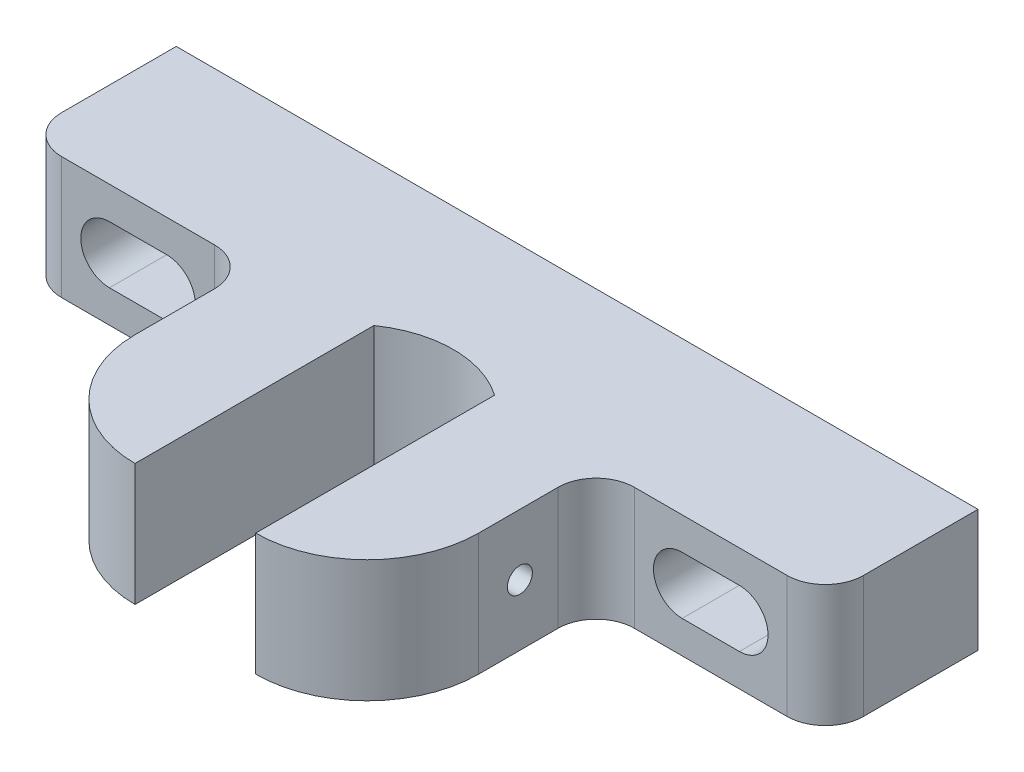
ISO-10303-21;
HEADER;
FILE_DESCRIPTION(('STEP AP214'),'2;1');
FILE_NAME('part.step','',(''),(''),'','','');
FILE_SCHEMA(('AUTOMOTIVE_DESIGN { 1 0 10303 214 1 1 1 1 }'));
ENDSEC;
DATA;
#1=APPLICATION_CONTEXT('core data for automotive mechanical design processes');
#2=APPLICATION_PROTOCOL_DEFINITION('international standard','automotive_design',2000,#1);
#3=PRODUCT_CONTEXT('',#1,'mechanical');
#4=PRODUCT('Part','Part','',(#3));
#5=PRODUCT_RELATED_PRODUCT_CATEGORY('part','',(#4));
#6=PRODUCT_DEFINITION_FORMATION('','',#4);
#7=PRODUCT_DEFINITION_CONTEXT('part definition',#1,'design');
#8=PRODUCT_DEFINITION('design','',#6,#7);
#9=PRODUCT_DEFINITION_SHAPE('','',#8);
#10=(LENGTH_UNIT() NAMED_UNIT(*) SI_UNIT(.MILLI.,.METRE.));
#11=(NAMED_UNIT(*) PLANE_ANGLE_UNIT() SI_UNIT($,.RADIAN.));
#12=(NAMED_UNIT(*) SI_UNIT($,.STERADIAN.) SOLID_ANGLE_UNIT());
#13=UNCERTAINTY_MEASURE_WITH_UNIT(LENGTH_MEASURE(1.E-05),#10,'distance_accuracy_value','');
#14=(GEOMETRIC_REPRESENTATION_CONTEXT(3) GLOBAL_UNCERTAINTY_ASSIGNED_CONTEXT((#13)) GLOBAL_UNIT_ASSIGNED_CONTEXT((#10,
#11,#12)) REPRESENTATION_CONTEXT('',''));
#15=CARTESIAN_POINT('',(0.,0.,0.));
#16=DIRECTION('',(0.,0.,1.));
#17=DIRECTION('',(1.,0.,0.));
#18=AXIS2_PLACEMENT_3D('',#15,#16,#17);
#19=CARTESIAN_POINT('',(28.5749999999999,24.2887500000001,44.9579999999981));
#20=DIRECTION('',(-1.,0.,0.));
#21=DIRECTION('',(0.,0.,1.));
#22=AXIS2_PLACEMENT_3D('',#19,#20,#21);
#23=PLANE('',#22);
#24=DIRECTION('',(0.,0.,-1.));
#25=VECTOR('',#24,1.);
#26=CARTESIAN_POINT('',(28.5749999999999,3.96875000000006,44.9579999999981));
#27=LINE('',#26,#25);
#28=CARTESIAN_POINT('',(28.5749999999999,3.96875000000006,44.9579999999981));
#29=VERTEX_POINT('',#28);
#30=CARTESIAN_POINT('',(28.5749999999999,3.96875000000006,31.75));
#31=VERTEX_POINT('',#30);
#32=EDGE_CURVE('E370',#29,#31,#27,.T.);
#33=ORIENTED_EDGE('',*,*,#32,.T.);
#34=DIRECTION('',(0.,-1.,0.));
#35=VECTOR('',#34,1.);
#36=CARTESIAN_POINT('',(28.5749999999999,24.2887500000001,31.75));
#37=LINE('',#36,#35);
#38=CARTESIAN_POINT('',(28.5749999999999,24.2887500000001,31.75));
#39=VERTEX_POINT('',#38);
#40=EDGE_CURVE('E420',#39,#31,#37,.T.);
#41=ORIENTED_EDGE('',*,*,#40,.F.);
#42=DIRECTION('',(0.,0.,-1.));
#43=VECTOR('',#42,1.);
#44=CARTESIAN_POINT('',(28.5749999999999,24.2887500000001,44.9579999999981));
#45=LINE('',#44,#43);
#46=CARTESIAN_POINT('',(28.5749999999999,24.2887500000001,44.9579999999981));
#47=VERTEX_POINT('',#46);
#48=EDGE_CURVE('E327',#47,#39,#45,.T.);
#49=ORIENTED_EDGE('',*,*,#48,.F.);
#50=DIRECTION('',(0.,-1.,0.));
#51=VECTOR('',#50,1.);
#52=CARTESIAN_POINT('',(28.5749999999999,24.2887500000001,44.9579999999981));
#53=LINE('',#52,#51);
#54=EDGE_CURVE('E423',#47,#29,#53,.T.);
#55=ORIENTED_EDGE('',*,*,#54,.T.);
#56=EDGE_LOOP('',(#33,#41,#49,#55));
#57=FACE_BOUND('',#56,.T.);
#58=CARTESIAN_POINT('',(28.5749999999999,14.1287500000001,38.1));
#59=DIRECTION('',(-1.,0.,0.));
#60=DIRECTION('',(0.,0.,1.));
#61=AXIS2_PLACEMENT_3D('',#58,#59,#60);
#62=CIRCLE('',#61,2.07645);
#63=CARTESIAN_POINT('',(28.5749999999999,14.1287500000001,40.17645));
#64=VERTEX_POINT('',#63);
#65=EDGE_CURVE('E731',#64,#64,#62,.F.);
#66=ORIENTED_EDGE('',*,*,#65,.F.);
#67=EDGE_LOOP('',(#66));
#68=FACE_BOUND('',#67,.T.);
#69=ADVANCED_FACE('F39',(#57,#68),#23,.F.);
#70=CARTESIAN_POINT('',(10.032999999998,24.2887500000001,23.7616280212914));
#71=DIRECTION('',(1.,0.,0.));
#72=DIRECTION('',(0.,0.,-1.));
#73=AXIS2_PLACEMENT_3D('',#70,#71,#72);
#74=PLANE('',#73);
#75=DIRECTION('',(0.,0.,1.));
#76=VECTOR('',#75,1.);
#77=CARTESIAN_POINT('',(10.032999999998,3.96875000000006,23.7616280212914));
#78=LINE('',#77,#76);
#79=CARTESIAN_POINT('',(10.032999999998,3.96875000000006,23.7616280212914));
#80=VERTEX_POINT('',#79);
#81=CARTESIAN_POINT('',(10.032999999998,3.96875000000006,63.5));
#82=VERTEX_POINT('',#81);
#83=EDGE_CURVE('E362',#80,#82,#78,.T.);
#84=ORIENTED_EDGE('',*,*,#83,.T.);
#85=DIRECTION('',(0.,-1.,0.));
#86=VECTOR('',#85,1.);
#87=CARTESIAN_POINT('',(10.032999999998,24.2887500000001,63.5));
#88=LINE('',#87,#86);
#89=CARTESIAN_POINT('',(10.032999999998,24.2887500000001,63.5));
#90=VERTEX_POINT('',#89);
#91=EDGE_CURVE('E426',#90,#82,#88,.T.);
#92=ORIENTED_EDGE('',*,*,#91,.F.);
#93=DIRECTION('',(0.,0.,1.));
#94=VECTOR('',#93,1.);
#95=CARTESIAN_POINT('',(10.032999999998,24.2887500000001,23.7616280212914));
#96=LINE('',#95,#94);
#97=CARTESIAN_POINT('',(10.032999999998,24.2887500000001,23.7616280212914));
#98=VERTEX_POINT('',#97);
#99=EDGE_CURVE('E318',#98,#90,#96,.T.);
#100=ORIENTED_EDGE('',*,*,#99,.F.);
#101=DIRECTION('',(0.,-1.,0.));
#102=VECTOR('',#101,1.);
#103=CARTESIAN_POINT('',(10.032999999998,24.2887500000001,23.7616280212914));
#104=LINE('',#103,#102);
#105=EDGE_CURVE('E358',#98,#80,#104,.T.);
#106=ORIENTED_EDGE('',*,*,#105,.T.);
#107=EDGE_LOOP('',(#84,#92,#100,#106));
#108=FACE_BOUND('',#107,.T.);
#109=CARTESIAN_POINT('',(10.032999999998,14.1287500000001,38.1));
#110=DIRECTION('',(1.,0.,0.));
#111=DIRECTION('',(0.,0.,-1.));
#112=AXIS2_PLACEMENT_3D('',#109,#110,#111);
#113=CIRCLE('',#112,2.07645);
#114=CARTESIAN_POINT('',(10.032999999998,14.1287500000001,36.02355));
#115=VERTEX_POINT('',#114);
#116=EDGE_CURVE('E43',#115,#115,#113,.F.);
#117=ORIENTED_EDGE('',*,*,#116,.F.);
#118=EDGE_LOOP('',(#117));
#119=FACE_BOUND('',#118,.T.);
#120=ADVANCED_FACE('F528',(#108,#119),#74,.F.);
#121=CARTESIAN_POINT('',(-66.6749999999999,24.2887500000001,63.5));
#122=DIRECTION('',(1.,0.,0.));
#123=DIRECTION('',(0.,0.,-1.));
#124=AXIS2_PLACEMENT_3D('',#121,#122,#123);
#125=PLANE('',#124);
#126=DIRECTION('',(0.,0.,-1.));
#127=VECTOR('',#126,1.);
#128=CARTESIAN_POINT('',(-66.6749999999999,3.96875000000006,63.5));
#129=LINE('',#128,#127);
#130=CARTESIAN_POINT('',(-66.6749999999999,3.96875000000006,19.05));
#131=VERTEX_POINT('',#130);
#132=CARTESIAN_POINT('',(-66.6749999999999,3.96875000000006,0.));
#133=VERTEX_POINT('',#132);
#134=EDGE_CURVE('E455',#131,#133,#129,.T.);
#135=ORIENTED_EDGE('',*,*,#134,.F.);
#136=DIRECTION('',(0.,-1.,0.));
#137=VECTOR('',#136,1.);
#138=CARTESIAN_POINT('',(-66.6749999999999,24.2887500000001,19.05));
#139=LINE('',#138,#137);
#140=CARTESIAN_POINT('',(-66.6749999999999,24.2887500000001,19.05));
#141=VERTEX_POINT('',#140);
#142=EDGE_CURVE('E481',#131,#141,#139,.F.);
#143=ORIENTED_EDGE('',*,*,#142,.T.);
#144=DIRECTION('',(0.,0.,-1.));
#145=VECTOR('',#144,1.);
#146=CARTESIAN_POINT('',(-66.6749999999999,24.2887500000001,63.5));
#147=LINE('',#146,#145);
#148=CARTESIAN_POINT('',(-66.6749999999999,24.2887500000001,0.));
#149=VERTEX_POINT('',#148);
#150=EDGE_CURVE('E446',#141,#149,#147,.T.);
#151=ORIENTED_EDGE('',*,*,#150,.T.);
#152=DIRECTION('',(0.,-1.,0.));
#153=VECTOR('',#152,1.);
#154=CARTESIAN_POINT('',(-66.6749999999999,24.2887500000001,0.));
#155=LINE('',#154,#153);
#156=EDGE_CURVE('E403',#149,#133,#155,.T.);
#157=ORIENTED_EDGE('',*,*,#156,.T.);
#158=EDGE_LOOP('',(#135,#143,#151,#157));
#159=FACE_BOUND('',#158,.T.);
#160=ADVANCED_FACE('F534',(#159),#125,.F.);
#161=CARTESIAN_POINT('',(-66.6749999999999,3.96875000000006,63.5));
#162=DIRECTION('',(0.,1.,0.));
#163=DIRECTION('',(0.,0.,1.));
#164=AXIS2_PLACEMENT_3D('',#161,#162,#163);
#165=PLANE('',#164);
#166=DIRECTION('',(0.,0.,-1.));
#167=VECTOR('',#166,1.);
#168=CARTESIAN_POINT('',(66.6750000000001,3.96875000000006,63.5));
#169=LINE('',#168,#167);
#170=CARTESIAN_POINT('',(66.6750000000001,3.96875000000006,19.05));
#171=VERTEX_POINT('',#170);
#172=CARTESIAN_POINT('',(66.6750000000001,3.96875000000006,0.));
#173=VERTEX_POINT('',#172);
#174=EDGE_CURVE('E452',#171,#173,#169,.T.);
#175=ORIENTED_EDGE('',*,*,#174,.F.);
#176=CARTESIAN_POINT('',(60.3250000000001,3.96875000000006,19.05));
#177=DIRECTION('',(0.,1.,0.));
#178=DIRECTION('',(0.,0.,1.));
#179=AXIS2_PLACEMENT_3D('',#176,#177,#178);
#180=CIRCLE('',#179,6.35);
#181=CARTESIAN_POINT('',(60.3250000000001,3.96875000000006,25.4));
#182=VERTEX_POINT('',#181);
#183=EDGE_CURVE('E465',#171,#182,#180,.F.);
#184=ORIENTED_EDGE('',*,*,#183,.T.);
#185=DIRECTION('',(1.,0.,0.));
#186=VECTOR('',#185,1.);
#187=CARTESIAN_POINT('',(66.6749999999999,3.96875000000006,25.4));
#188=LINE('',#187,#186);
#189=CARTESIAN_POINT('',(34.9249999999999,3.96875000000006,25.4));
#190=VERTEX_POINT('',#189);
#191=EDGE_CURVE('E378',#190,#182,#188,.T.);
#192=ORIENTED_EDGE('',*,*,#191,.F.);
#193=CARTESIAN_POINT('',(34.9249999999999,3.96875000000006,31.75));
#194=DIRECTION('',(0.,-1.,0.));
#195=DIRECTION('',(0.,0.,1.));
#196=AXIS2_PLACEMENT_3D('',#193,#194,#195);
#197=CIRCLE('',#196,6.35);
#198=EDGE_CURVE('E374',#31,#190,#197,.T.);
#199=ORIENTED_EDGE('',*,*,#198,.F.);
#200=ORIENTED_EDGE('',*,*,#32,.F.);
#201=CARTESIAN_POINT('',(10.032999999998,3.96875000000006,44.9579999999981));
#202=DIRECTION('',(0.,1.,0.));
#203=DIRECTION('',(0.,0.,1.));
#204=AXIS2_PLACEMENT_3D('',#201,#202,#203);
#205=CIRCLE('',#204,18.5420000000019);
#206=EDGE_CURVE('E366',#82,#29,#205,.T.);
#207=ORIENTED_EDGE('',*,*,#206,.F.);
#208=ORIENTED_EDGE('',*,*,#83,.F.);
#209=CARTESIAN_POINT('',(0.,3.96875000000006,38.1000000000061));
#210=DIRECTION('',(0.,-1.,0.));
#211=DIRECTION('',(0.,0.,1.));
#212=AXIS2_PLACEMENT_3D('',#209,#210,#211);
#213=CIRCLE('',#212,17.4999999999986);
#214=CARTESIAN_POINT('',(-10.032999999998,3.96875000000006,23.7616280212914));
#215=VERTEX_POINT('',#214);
#216=EDGE_CURVE('E304',#215,#80,#213,.T.);
#217=ORIENTED_EDGE('',*,*,#216,.F.);
#218=DIRECTION('',(0.,0.,-1.));
#219=VECTOR('',#218,1.);
#220=CARTESIAN_POINT('',(-10.032999999998,3.96875000000006,23.7616280212914));
#221=LINE('',#220,#219);
#222=CARTESIAN_POINT('',(-10.032999999998,3.96875000000006,63.5));
#223=VERTEX_POINT('',#222);
#224=EDGE_CURVE('E319',#223,#215,#221,.T.);
#225=ORIENTED_EDGE('',*,*,#224,.F.);
#226=CARTESIAN_POINT('',(-10.032999999998,3.96875000000006,44.9579999999981));
#227=DIRECTION('',(0.,1.,0.));
#228=DIRECTION('',(0.,0.,-1.));
#229=AXIS2_PLACEMENT_3D('',#226,#227,#228);
#230=CIRCLE('',#229,18.5420000000019);
#231=CARTESIAN_POINT('',(-28.5749999999999,3.96875000000006,44.9579999999981));
#232=VERTEX_POINT('',#231);
#233=EDGE_CURVE('E393',#232,#223,#230,.T.);
#234=ORIENTED_EDGE('',*,*,#233,.F.);
#235=DIRECTION('',(0.,0.,1.));
#236=VECTOR('',#235,1.);
#237=CARTESIAN_POINT('',(-28.5749999999999,3.96875000000006,44.9579999999981));
#238=LINE('',#237,#236);
#239=CARTESIAN_POINT('',(-28.5749999999999,3.96875000000006,31.75));
#240=VERTEX_POINT('',#239);
#241=EDGE_CURVE('E389',#240,#232,#238,.T.);
#242=ORIENTED_EDGE('',*,*,#241,.F.);
#243=CARTESIAN_POINT('',(-34.9249999999999,3.96875000000006,31.75));
#244=DIRECTION('',(0.,-1.,0.));
#245=DIRECTION('',(0.,0.,-1.));
#246=AXIS2_PLACEMENT_3D('',#243,#244,#245);
#247=CIRCLE('',#246,6.35);
#248=CARTESIAN_POINT('',(-34.9249999999999,3.96875000000006,25.4));
#249=VERTEX_POINT('',#248);
#250=EDGE_CURVE('E385',#249,#240,#247,.T.);
#251=ORIENTED_EDGE('',*,*,#250,.F.);
#252=DIRECTION('',(1.,0.,0.));
#253=VECTOR('',#252,1.);
#254=CARTESIAN_POINT('',(-66.6749999999999,3.96875000000006,25.4));
#255=LINE('',#254,#253);
#256=CARTESIAN_POINT('',(-60.3249999999999,3.96875000000006,25.4));
#257=VERTEX_POINT('',#256);
#258=EDGE_CURVE('E382',#257,#249,#255,.T.);
#259=ORIENTED_EDGE('',*,*,#258,.F.);
#260=CARTESIAN_POINT('',(-60.3249999999999,3.96875000000006,19.05));
#261=DIRECTION('',(0.,1.,0.));
#262=DIRECTION('',(0.,0.,1.));
#263=AXIS2_PLACEMENT_3D('',#260,#261,#262);
#264=CIRCLE('',#263,6.35);
#265=EDGE_CURVE('E462',#257,#131,#264,.F.);
#266=ORIENTED_EDGE('',*,*,#265,.T.);
#267=ORIENTED_EDGE('',*,*,#134,.T.);
#268=DIRECTION('',(1.,0.,0.));
#269=VECTOR('',#268,1.);
#270=CARTESIAN_POINT('',(-66.6749999999999,3.96875000000006,0.));
#271=LINE('',#270,#269);
#272=EDGE_CURVE('E434',#133,#173,#271,.T.);
#273=ORIENTED_EDGE('',*,*,#272,.T.);
#274=EDGE_LOOP('',(#175,#184,#192,#199,#200,#207,#208,#217,#225,#234,#242,#251,#259,#266,#267,#273));
#275=FACE_BOUND('',#274,.T.);
#276=ADVANCED_FACE('F561',(#275),#165,.F.);
#277=CARTESIAN_POINT('',(66.6750000000001,24.2887500000001,63.5));
#278=DIRECTION('',(-1.,0.,0.));
#279=DIRECTION('',(0.,0.,1.));
#280=AXIS2_PLACEMENT_3D('',#277,#278,#279);
#281=PLANE('',#280);
#282=DIRECTION('',(0.,0.,-1.));
#283=VECTOR('',#282,1.);
#284=CARTESIAN_POINT('',(66.6750000000001,24.2887500000001,63.5));
#285=LINE('',#284,#283);
#286=CARTESIAN_POINT('',(66.6750000000001,24.2887500000001,19.05));
#287=VERTEX_POINT('',#286);
#288=CARTESIAN_POINT('',(66.6750000000001,24.2887500000001,0.));
#289=VERTEX_POINT('',#288);
#290=EDGE_CURVE('E449',#287,#289,#285,.T.);
#291=ORIENTED_EDGE('',*,*,#290,.F.);
#292=DIRECTION('',(0.,-1.,0.));
#293=VECTOR('',#292,1.);
#294=CARTESIAN_POINT('',(66.6750000000001,24.2887500000001,19.05));
#295=LINE('',#294,#293);
#296=EDGE_CURVE('E458',#287,#171,#295,.T.);
#297=ORIENTED_EDGE('',*,*,#296,.T.);
#298=ORIENTED_EDGE('',*,*,#174,.T.);
#299=DIRECTION('',(0.,1.,0.));
#300=VECTOR('',#299,1.);
#301=CARTESIAN_POINT('',(66.6750000000001,24.2887500000001,0.));
#302=LINE('',#301,#300);
#303=EDGE_CURVE('E438',#173,#289,#302,.T.);
#304=ORIENTED_EDGE('',*,*,#303,.T.);
#305=EDGE_LOOP('',(#291,#297,#298,#304));
#306=FACE_BOUND('',#305,.T.);
#307=ADVANCED_FACE('F557',(#306),#281,.F.);
#308=CARTESIAN_POINT('',(-66.6749999999999,24.2887500000001,63.5));
#309=DIRECTION('',(0.,-1.,0.));
#310=DIRECTION('',(0.,0.,-1.));
#311=AXIS2_PLACEMENT_3D('',#308,#309,#310);
#312=PLANE('',#311);
#313=DIRECTION('',(1.,0.,0.));
#314=VECTOR('',#313,1.);
#315=CARTESIAN_POINT('',(66.6749999999999,24.2887500000001,25.4));
#316=LINE('',#315,#314);
#317=CARTESIAN_POINT('',(34.9249999999999,24.2887500000001,25.4));
#318=VERTEX_POINT('',#317);
#319=CARTESIAN_POINT('',(60.3250000000001,24.2887500000001,25.4));
#320=VERTEX_POINT('',#319);
#321=EDGE_CURVE('E335',#318,#320,#316,.T.);
#322=ORIENTED_EDGE('',*,*,#321,.T.);
#323=CARTESIAN_POINT('',(60.3250000000001,24.2887500000001,19.05));
#324=DIRECTION('',(0.,-1.,0.));
#325=DIRECTION('',(0.,0.,-1.));
#326=AXIS2_PLACEMENT_3D('',#323,#324,#325);
#327=CIRCLE('',#326,6.35);
#328=EDGE_CURVE('E474',#320,#287,#327,.F.);
#329=ORIENTED_EDGE('',*,*,#328,.T.);
#330=ORIENTED_EDGE('',*,*,#290,.T.);
#331=DIRECTION('',(-1.,0.,0.));
#332=VECTOR('',#331,1.);
#333=CARTESIAN_POINT('',(-66.6749999999999,24.2887500000001,0.));
#334=LINE('',#333,#332);
#335=EDGE_CURVE('E442',#289,#149,#334,.T.);
#336=ORIENTED_EDGE('',*,*,#335,.T.);
#337=ORIENTED_EDGE('',*,*,#150,.F.);
#338=CARTESIAN_POINT('',(-60.3249999999999,24.2887500000001,19.05));
#339=DIRECTION('',(0.,-1.,0.));
#340=DIRECTION('',(0.,0.,-1.));
#341=AXIS2_PLACEMENT_3D('',#338,#339,#340);
#342=CIRCLE('',#341,6.35);
#343=CARTESIAN_POINT('',(-60.3249999999999,24.2887500000001,25.4));
#344=VERTEX_POINT('',#343);
#345=EDGE_CURVE('E471',#141,#344,#342,.F.);
#346=ORIENTED_EDGE('',*,*,#345,.T.);
#347=DIRECTION('',(1.,0.,0.));
#348=VECTOR('',#347,1.);
#349=CARTESIAN_POINT('',(-66.6749999999999,24.2887500000001,25.4));
#350=LINE('',#349,#348);
#351=CARTESIAN_POINT('',(-34.9249999999999,24.2887500000001,25.4));
#352=VERTEX_POINT('',#351);
#353=EDGE_CURVE('E339',#344,#352,#350,.T.);
#354=ORIENTED_EDGE('',*,*,#353,.T.);
#355=CARTESIAN_POINT('',(-34.9249999999999,24.2887500000001,31.75));
#356=DIRECTION('',(0.,-1.,0.));
#357=DIRECTION('',(0.,0.,-1.));
#358=AXIS2_PLACEMENT_3D('',#355,#356,#357);
#359=CIRCLE('',#358,6.35);
#360=CARTESIAN_POINT('',(-28.5749999999999,24.2887500000001,31.75));
#361=VERTEX_POINT('',#360);
#362=EDGE_CURVE('E342',#352,#361,#359,.T.);
#363=ORIENTED_EDGE('',*,*,#362,.T.);
#364=DIRECTION('',(0.,0.,1.));
#365=VECTOR('',#364,1.);
#366=CARTESIAN_POINT('',(-28.5749999999999,24.2887500000001,44.9579999999981));
#367=LINE('',#366,#365);
#368=CARTESIAN_POINT('',(-28.5749999999999,24.2887500000001,44.9579999999981));
#369=VERTEX_POINT('',#368);
#370=EDGE_CURVE('E346',#361,#369,#367,.T.);
#371=ORIENTED_EDGE('',*,*,#370,.T.);
#372=CARTESIAN_POINT('',(-10.032999999998,24.2887500000001,44.9579999999981));
#373=DIRECTION('',(0.,1.,0.));
#374=DIRECTION('',(0.,0.,-1.));
#375=AXIS2_PLACEMENT_3D('',#372,#373,#374);
#376=CIRCLE('',#375,18.5420000000019);
#377=CARTESIAN_POINT('',(-10.032999999998,24.2887500000001,63.5));
#378=VERTEX_POINT('',#377);
#379=EDGE_CURVE('E350',#369,#378,#376,.T.);
#380=ORIENTED_EDGE('',*,*,#379,.T.);
#381=DIRECTION('',(0.,0.,-1.));
#382=VECTOR('',#381,1.);
#383=CARTESIAN_POINT('',(-10.032999999998,24.2887500000001,23.7616280212914));
#384=LINE('',#383,#382);
#385=CARTESIAN_POINT('',(-10.032999999998,24.2887500000001,23.7616280212914));
#386=VERTEX_POINT('',#385);
#387=EDGE_CURVE('E354',#378,#386,#384,.T.);
#388=ORIENTED_EDGE('',*,*,#387,.T.);
#389=CARTESIAN_POINT('',(0.,24.2887500000001,38.1000000000061));
#390=DIRECTION('',(0.,-1.,0.));
#391=DIRECTION('',(0.,0.,1.));
#392=AXIS2_PLACEMENT_3D('',#389,#390,#391);
#393=CIRCLE('',#392,17.4999999999986);
#394=EDGE_CURVE('E314',#386,#98,#393,.T.);
#395=ORIENTED_EDGE('',*,*,#394,.T.);
#396=ORIENTED_EDGE('',*,*,#99,.T.);
#397=CARTESIAN_POINT('',(10.032999999998,24.2887500000001,44.9579999999981));
#398=DIRECTION('',(0.,1.,0.));
#399=DIRECTION('',(0.,0.,1.));
#400=AXIS2_PLACEMENT_3D('',#397,#398,#399);
#401=CIRCLE('',#400,18.5420000000019);
#402=EDGE_CURVE('E323',#90,#47,#401,.T.);
#403=ORIENTED_EDGE('',*,*,#402,.T.);
#404=ORIENTED_EDGE('',*,*,#48,.T.);
#405=CARTESIAN_POINT('',(34.9249999999999,24.2887500000001,31.75));
#406=DIRECTION('',(0.,-1.,0.));
#407=DIRECTION('',(0.,0.,1.));
#408=AXIS2_PLACEMENT_3D('',#405,#406,#407);
#409=CIRCLE('',#408,6.35);
#410=EDGE_CURVE('E331',#39,#318,#409,.T.);
#411=ORIENTED_EDGE('',*,*,#410,.T.);
#412=EDGE_LOOP('',(#322,#329,#330,#336,#337,#346,#354,#363,#371,#380,#388,#395,#396,#403,#404,#411));
#413=FACE_BOUND('',#412,.T.);
#414=ADVANCED_FACE('F554',(#413),#312,.F.);
#415=CARTESIAN_POINT('',(-66.6749999999999,3.96875000000006,0.));
#416=DIRECTION('',(0.,0.,1.));
#417=DIRECTION('',(1.,0.,0.));
#418=AXIS2_PLACEMENT_3D('',#415,#416,#417);
#419=PLANE('',#418);
#420=DIRECTION('',(1.,0.,0.));
#421=VECTOR('',#420,1.);
#422=CARTESIAN_POINT('',(-52.3875,18.8912500000001,0.));
#423=LINE('',#422,#421);
#424=CARTESIAN_POINT('',(-52.3875,18.8912500000001,0.));
#425=VERTEX_POINT('',#424);
#426=CARTESIAN_POINT('',(-42.8625,18.8912500000001,0.));
#427=VERTEX_POINT('',#426);
#428=EDGE_CURVE('E263',#425,#427,#423,.T.);
#429=ORIENTED_EDGE('',*,*,#428,.F.);
#430=CARTESIAN_POINT('',(-52.3875,14.1287500000001,0.));
#431=DIRECTION('',(0.,0.,-1.));
#432=DIRECTION('',(-1.,0.,0.));
#433=AXIS2_PLACEMENT_3D('',#430,#431,#432);
#434=CIRCLE('',#433,4.7625);
#435=CARTESIAN_POINT('',(-52.3875,9.36625000000008,0.));
#436=VERTEX_POINT('',#435);
#437=EDGE_CURVE('E59',#436,#425,#434,.T.);
#438=ORIENTED_EDGE('',*,*,#437,.F.);
#439=DIRECTION('',(-1.,0.,0.));
#440=VECTOR('',#439,1.);
#441=CARTESIAN_POINT('',(-52.3875,9.36625000000008,0.));
#442=LINE('',#441,#440);
#443=CARTESIAN_POINT('',(-42.8625,9.36625000000008,0.));
#444=VERTEX_POINT('',#443);
#445=EDGE_CURVE('E271',#444,#436,#442,.T.);
#446=ORIENTED_EDGE('',*,*,#445,.F.);
#447=CARTESIAN_POINT('',(-42.8625,14.1287500000001,0.));
#448=DIRECTION('',(0.,0.,-1.));
#449=DIRECTION('',(-1.,0.,0.));
#450=AXIS2_PLACEMENT_3D('',#447,#448,#449);
#451=CIRCLE('',#450,4.7625);
#452=EDGE_CURVE('E253',#427,#444,#451,.T.);
#453=ORIENTED_EDGE('',*,*,#452,.F.);
#454=EDGE_LOOP('',(#429,#438,#446,#453));
#455=FACE_BOUND('',#454,.T.);
#456=DIRECTION('',(-1.,0.,0.));
#457=VECTOR('',#456,1.);
#458=CARTESIAN_POINT('',(52.3875,9.36625000000008,0.));
#459=LINE('',#458,#457);
#460=CARTESIAN_POINT('',(52.3875,9.36625000000008,0.));
#461=VERTEX_POINT('',#460);
#462=CARTESIAN_POINT('',(42.8625,9.36625000000007,0.));
#463=VERTEX_POINT('',#462);
#464=EDGE_CURVE('E288',#461,#463,#459,.T.);
#465=ORIENTED_EDGE('',*,*,#464,.F.);
#466=CARTESIAN_POINT('',(52.3875,14.1287500000001,0.));
#467=DIRECTION('',(0.,0.,-1.));
#468=DIRECTION('',(1.,0.,0.));
#469=AXIS2_PLACEMENT_3D('',#466,#467,#468);
#470=CIRCLE('',#469,4.7625);
#471=CARTESIAN_POINT('',(52.3875,18.8912500000001,0.));
#472=VERTEX_POINT('',#471);
#473=EDGE_CURVE('E281',#472,#461,#470,.T.);
#474=ORIENTED_EDGE('',*,*,#473,.F.);
#475=DIRECTION('',(1.,0.,0.));
#476=VECTOR('',#475,1.);
#477=CARTESIAN_POINT('',(52.3875,18.8912500000001,0.));
#478=LINE('',#477,#476);
#479=CARTESIAN_POINT('',(42.8625,18.8912500000001,0.));
#480=VERTEX_POINT('',#479);
#481=EDGE_CURVE('E296',#480,#472,#478,.T.);
#482=ORIENTED_EDGE('',*,*,#481,.F.);
#483=CARTESIAN_POINT('',(42.8625,14.1287500000001,0.));
#484=DIRECTION('',(0.,0.,-1.));
#485=DIRECTION('',(1.,0.,0.));
#486=AXIS2_PLACEMENT_3D('',#483,#484,#485);
#487=CIRCLE('',#486,4.7625);
#488=EDGE_CURVE('E292',#463,#480,#487,.T.);
#489=ORIENTED_EDGE('',*,*,#488,.F.);
#490=EDGE_LOOP('',(#465,#474,#482,#489));
#491=FACE_BOUND('',#490,.T.);
#492=ORIENTED_EDGE('',*,*,#156,.F.);
#493=ORIENTED_EDGE('',*,*,#335,.F.);
#494=ORIENTED_EDGE('',*,*,#303,.F.);
#495=ORIENTED_EDGE('',*,*,#272,.F.);
#496=EDGE_LOOP('',(#492,#493,#494,#495));
#497=FACE_BOUND('',#496,.T.);
#498=ADVANCED_FACE('F268',(#455,#491,#497),#419,.F.);
#499=CARTESIAN_POINT('',(0.,24.2887500000001,38.1000000000061));
#500=DIRECTION('',(0.,-1.,0.));
#501=DIRECTION('',(0.,0.,-1.));
#502=AXIS2_PLACEMENT_3D('',#499,#500,#501);
#503=CYLINDRICAL_SURFACE('',#502,17.4999999999986);
#504=ORIENTED_EDGE('',*,*,#216,.T.);
#505=ORIENTED_EDGE('',*,*,#105,.F.);
#506=ORIENTED_EDGE('',*,*,#394,.F.);
#507=DIRECTION('',(0.,-1.,0.));
#508=VECTOR('',#507,1.);
#509=CARTESIAN_POINT('',(-10.032999999998,24.2887500000001,23.7616280212914));
#510=LINE('',#509,#508);
#511=EDGE_CURVE('E400',#386,#215,#510,.T.);
#512=ORIENTED_EDGE('',*,*,#511,.T.);
#513=EDGE_LOOP('',(#504,#505,#506,#512));
#514=FACE_BOUND('',#513,.T.);
#515=ADVANCED_FACE('F547',(#514),#503,.F.);
#516=CARTESIAN_POINT('',(-10.032999999998,24.2887500000001,23.7616280212914));
#517=DIRECTION('',(-1.,0.,0.));
#518=DIRECTION('',(0.,0.,1.));
#519=AXIS2_PLACEMENT_3D('',#516,#517,#518);
#520=PLANE('',#519);
#521=ORIENTED_EDGE('',*,*,#224,.T.);
#522=ORIENTED_EDGE('',*,*,#511,.F.);
#523=ORIENTED_EDGE('',*,*,#387,.F.);
#524=DIRECTION('',(0.,-1.,0.));
#525=VECTOR('',#524,1.);
#526=CARTESIAN_POINT('',(-10.032999999998,24.2887500000001,63.5));
#527=LINE('',#526,#525);
#528=EDGE_CURVE('E404',#378,#223,#527,.T.);
#529=ORIENTED_EDGE('',*,*,#528,.T.);
#530=EDGE_LOOP('',(#521,#522,#523,#529));
#531=FACE_BOUND('',#530,.T.);
#532=ADVANCED_FACE('F550',(#531),#520,.F.);
#533=CARTESIAN_POINT('',(-10.032999999998,24.2887500000001,44.9579999999981));
#534=DIRECTION('',(0.,-1.,0.));
#535=DIRECTION('',(0.,0.,-1.));
#536=AXIS2_PLACEMENT_3D('',#533,#534,#535);
#537=CYLINDRICAL_SURFACE('',#536,18.5420000000019);
#538=ORIENTED_EDGE('',*,*,#233,.T.);
#539=ORIENTED_EDGE('',*,*,#528,.F.);
#540=ORIENTED_EDGE('',*,*,#379,.F.);
#541=DIRECTION('',(0.,-1.,0.));
#542=VECTOR('',#541,1.);
#543=CARTESIAN_POINT('',(-28.5749999999999,24.2887500000001,44.9579999999981));
#544=LINE('',#543,#542);
#545=EDGE_CURVE('E407',#369,#232,#544,.T.);
#546=ORIENTED_EDGE('',*,*,#545,.T.);
#547=EDGE_LOOP('',(#538,#539,#540,#546));
#548=FACE_BOUND('',#547,.T.);
#549=ADVANCED_FACE('F605',(#548),#537,.T.);
#550=CARTESIAN_POINT('',(-28.5749999999999,24.2887500000001,44.9579999999981));
#551=DIRECTION('',(1.,0.,0.));
#552=DIRECTION('',(0.,0.,-1.));
#553=AXIS2_PLACEMENT_3D('',#550,#551,#552);
#554=PLANE('',#553);
#555=ORIENTED_EDGE('',*,*,#241,.T.);
#556=ORIENTED_EDGE('',*,*,#545,.F.);
#557=ORIENTED_EDGE('',*,*,#370,.F.);
#558=DIRECTION('',(0.,-1.,0.));
#559=VECTOR('',#558,1.);
#560=CARTESIAN_POINT('',(-28.5749999999999,24.2887500000001,31.75));
#561=LINE('',#560,#559);
#562=EDGE_CURVE('E410',#361,#240,#561,.T.);
#563=ORIENTED_EDGE('',*,*,#562,.T.);
#564=EDGE_LOOP('',(#555,#556,#557,#563));
#565=FACE_BOUND('',#564,.T.);
#566=ADVANCED_FACE('F603',(#565),#554,.F.);
#567=CARTESIAN_POINT('',(-34.9249999999999,24.2887500000001,31.75));
#568=DIRECTION('',(0.,-1.,0.));
#569=DIRECTION('',(0.,0.,-1.));
#570=AXIS2_PLACEMENT_3D('',#567,#568,#569);
#571=CYLINDRICAL_SURFACE('',#570,6.35);
#572=ORIENTED_EDGE('',*,*,#250,.T.);
#573=ORIENTED_EDGE('',*,*,#562,.F.);
#574=ORIENTED_EDGE('',*,*,#362,.F.);
#575=DIRECTION('',(0.,-1.,0.));
#576=VECTOR('',#575,1.);
#577=CARTESIAN_POINT('',(-34.9249999999999,24.2887500000001,25.4));
#578=LINE('',#577,#576);
#579=EDGE_CURVE('E413',#352,#249,#578,.T.);
#580=ORIENTED_EDGE('',*,*,#579,.T.);
#581=EDGE_LOOP('',(#572,#573,#574,#580));
#582=FACE_BOUND('',#581,.T.);
#583=ADVANCED_FACE('F598',(#582),#571,.F.);
#584=CARTESIAN_POINT('',(-66.6749999999999,24.2887500000001,25.4));
#585=DIRECTION('',(0.,0.,-1.));
#586=DIRECTION('',(-1.,0.,0.));
#587=AXIS2_PLACEMENT_3D('',#584,#585,#586);
#588=PLANE('',#587);
#589=DIRECTION('',(-1.,0.,0.));
#590=VECTOR('',#589,1.);
#591=CARTESIAN_POINT('',(-66.6749999999999,9.36625000000008,25.4));
#592=LINE('',#591,#590);
#593=CARTESIAN_POINT('',(-42.8625,9.36625000000008,25.4));
#594=VERTEX_POINT('',#593);
#595=CARTESIAN_POINT('',(-52.3875,9.36625000000008,25.4));
#596=VERTEX_POINT('',#595);
#597=EDGE_CURVE('E49',#594,#596,#592,.T.);
#598=ORIENTED_EDGE('',*,*,#597,.T.);
#599=CARTESIAN_POINT('',(-52.3875,14.1287500000001,25.4));
#600=DIRECTION('',(0.,0.,-1.));
#601=DIRECTION('',(-1.,0.,0.));
#602=AXIS2_PLACEMENT_3D('',#599,#600,#601);
#603=CIRCLE('',#602,4.7625);
#604=CARTESIAN_POINT('',(-52.3875,18.8912500000001,25.4));
#605=VERTEX_POINT('',#604);
#606=EDGE_CURVE('E11',#596,#605,#603,.T.);
#607=ORIENTED_EDGE('',*,*,#606,.T.);
#608=DIRECTION('',(1.,0.,0.));
#609=VECTOR('',#608,1.);
#610=CARTESIAN_POINT('',(-66.6749999999999,18.8912500000001,25.4));
#611=LINE('',#610,#609);
#612=CARTESIAN_POINT('',(-42.8625,18.8912500000001,25.4));
#613=VERTEX_POINT('',#612);
#614=EDGE_CURVE('E500',#605,#613,#611,.T.);
#615=ORIENTED_EDGE('',*,*,#614,.T.);
#616=CARTESIAN_POINT('',(-42.8625,14.1287500000001,25.4));
#617=DIRECTION('',(0.,0.,-1.));
#618=DIRECTION('',(-1.,0.,0.));
#619=AXIS2_PLACEMENT_3D('',#616,#617,#618);
#620=CIRCLE('',#619,4.7625);
#621=EDGE_CURVE('E256',#613,#594,#620,.T.);
#622=ORIENTED_EDGE('',*,*,#621,.T.);
#623=EDGE_LOOP('',(#598,#607,#615,#622));
#624=FACE_BOUND('',#623,.T.);
#625=ORIENTED_EDGE('',*,*,#353,.F.);
#626=DIRECTION('',(0.,-1.,0.));
#627=VECTOR('',#626,1.);
#628=CARTESIAN_POINT('',(-60.3249999999999,24.2887500000001,25.4));
#629=LINE('',#628,#627);
#630=EDGE_CURVE('E477',#344,#257,#629,.T.);
#631=ORIENTED_EDGE('',*,*,#630,.T.);
#632=ORIENTED_EDGE('',*,*,#258,.T.);
#633=ORIENTED_EDGE('',*,*,#579,.F.);
#634=EDGE_LOOP('',(#625,#631,#632,#633));
#635=FACE_BOUND('',#634,.T.);
#636=ADVANCED_FACE('F508',(#624,#635),#588,.F.);
#637=CARTESIAN_POINT('',(66.6749999999999,24.2887500000001,25.4));
#638=DIRECTION('',(0.,0.,-1.));
#639=DIRECTION('',(-1.,0.,0.));
#640=AXIS2_PLACEMENT_3D('',#637,#638,#639);
#641=PLANE('',#640);
#642=DIRECTION('',(1.,0.,0.));
#643=VECTOR('',#642,1.);
#644=CARTESIAN_POINT('',(66.6749999999999,18.8912500000001,25.4));
#645=LINE('',#644,#643);
#646=CARTESIAN_POINT('',(42.8625,18.8912500000001,25.4));
#647=VERTEX_POINT('',#646);
#648=CARTESIAN_POINT('',(52.3875,18.8912500000001,25.4));
#649=VERTEX_POINT('',#648);
#650=EDGE_CURVE('E492',#647,#649,#645,.T.);
#651=ORIENTED_EDGE('',*,*,#650,.T.);
#652=CARTESIAN_POINT('',(52.3875,14.1287500000001,25.4));
#653=DIRECTION('',(0.,0.,-1.));
#654=DIRECTION('',(-1.,0.,0.));
#655=AXIS2_PLACEMENT_3D('',#652,#653,#654);
#656=CIRCLE('',#655,4.7625);
#657=CARTESIAN_POINT('',(52.3875,9.36625000000008,25.4));
#658=VERTEX_POINT('',#657);
#659=EDGE_CURVE('E496',#649,#658,#656,.T.);
#660=ORIENTED_EDGE('',*,*,#659,.T.);
#661=DIRECTION('',(-1.,0.,0.));
#662=VECTOR('',#661,1.);
#663=CARTESIAN_POINT('',(66.6749999999999,9.36625000000008,25.4));
#664=LINE('',#663,#662);
#665=CARTESIAN_POINT('',(42.8625,9.36625000000008,25.4));
#666=VERTEX_POINT('',#665);
#667=EDGE_CURVE('E484',#658,#666,#664,.T.);
#668=ORIENTED_EDGE('',*,*,#667,.T.);
#669=CARTESIAN_POINT('',(42.8625,14.1287500000001,25.4));
#670=DIRECTION('',(0.,0.,-1.));
#671=DIRECTION('',(-1.,0.,0.));
#672=AXIS2_PLACEMENT_3D('',#669,#670,#671);
#673=CIRCLE('',#672,4.7625);
#674=EDGE_CURVE('E488',#666,#647,#673,.T.);
#675=ORIENTED_EDGE('',*,*,#674,.T.);
#676=EDGE_LOOP('',(#651,#660,#668,#675));
#677=FACE_BOUND('',#676,.T.);
#678=ORIENTED_EDGE('',*,*,#191,.T.);
#679=DIRECTION('',(0.,-1.,0.));
#680=VECTOR('',#679,1.);
#681=CARTESIAN_POINT('',(60.3250000000001,24.2887500000001,25.4));
#682=LINE('',#681,#680);
#683=EDGE_CURVE('E468',#182,#320,#682,.F.);
#684=ORIENTED_EDGE('',*,*,#683,.T.);
#685=ORIENTED_EDGE('',*,*,#321,.F.);
#686=DIRECTION('',(0.,-1.,0.));
#687=VECTOR('',#686,1.);
#688=CARTESIAN_POINT('',(34.9249999999999,24.2887500000001,25.4));
#689=LINE('',#688,#687);
#690=EDGE_CURVE('E417',#318,#190,#689,.T.);
#691=ORIENTED_EDGE('',*,*,#690,.T.);
#692=EDGE_LOOP('',(#678,#684,#685,#691));
#693=FACE_BOUND('',#692,.T.);
#694=ADVANCED_FACE('F623',(#677,#693),#641,.F.);
#695=CARTESIAN_POINT('',(34.9249999999999,24.2887500000001,31.75));
#696=DIRECTION('',(0.,-1.,0.));
#697=DIRECTION('',(0.,0.,-1.));
#698=AXIS2_PLACEMENT_3D('',#695,#696,#697);
#699=CYLINDRICAL_SURFACE('',#698,6.35);
#700=ORIENTED_EDGE('',*,*,#198,.T.);
#701=ORIENTED_EDGE('',*,*,#690,.F.);
#702=ORIENTED_EDGE('',*,*,#410,.F.);
#703=ORIENTED_EDGE('',*,*,#40,.T.);
#704=EDGE_LOOP('',(#700,#701,#702,#703));
#705=FACE_BOUND('',#704,.T.);
#706=ADVANCED_FACE('F540',(#705),#699,.F.);
#707=CARTESIAN_POINT('',(10.032999999998,24.2887500000001,44.9579999999981));
#708=DIRECTION('',(0.,-1.,0.));
#709=DIRECTION('',(0.,0.,-1.));
#710=AXIS2_PLACEMENT_3D('',#707,#708,#709);
#711=CYLINDRICAL_SURFACE('',#710,18.5420000000019);
#712=ORIENTED_EDGE('',*,*,#206,.T.);
#713=ORIENTED_EDGE('',*,*,#54,.F.);
#714=ORIENTED_EDGE('',*,*,#402,.F.);
#715=ORIENTED_EDGE('',*,*,#91,.T.);
#716=EDGE_LOOP('',(#712,#713,#714,#715));
#717=FACE_BOUND('',#716,.T.);
#718=ADVANCED_FACE('F542',(#717),#711,.T.);
#719=CARTESIAN_POINT('',(60.3250000000001,24.2887500000001,19.05));
#720=DIRECTION('',(0.,-1.,0.));
#721=DIRECTION('',(0.,0.,-1.));
#722=AXIS2_PLACEMENT_3D('',#719,#720,#721);
#723=CYLINDRICAL_SURFACE('',#722,6.35);
#724=ORIENTED_EDGE('',*,*,#328,.F.);
#725=ORIENTED_EDGE('',*,*,#683,.F.);
#726=ORIENTED_EDGE('',*,*,#183,.F.);
#727=ORIENTED_EDGE('',*,*,#296,.F.);
#728=EDGE_LOOP('',(#724,#725,#726,#727));
#729=FACE_BOUND('',#728,.T.);
#730=ADVANCED_FACE('F544',(#729),#723,.T.);
#731=CARTESIAN_POINT('',(-60.3249999999999,24.2887500000001,19.05));
#732=DIRECTION('',(0.,-1.,0.));
#733=DIRECTION('',(0.,0.,-1.));
#734=AXIS2_PLACEMENT_3D('',#731,#732,#733);
#735=CYLINDRICAL_SURFACE('',#734,6.35);
#736=ORIENTED_EDGE('',*,*,#345,.F.);
#737=ORIENTED_EDGE('',*,*,#142,.F.);
#738=ORIENTED_EDGE('',*,*,#265,.F.);
#739=ORIENTED_EDGE('',*,*,#630,.F.);
#740=EDGE_LOOP('',(#736,#737,#738,#739));
#741=FACE_BOUND('',#740,.T.);
#742=ADVANCED_FACE('F41',(#741),#735,.T.);
#743=CARTESIAN_POINT('',(52.3875,14.1287500000001,63.5));
#744=DIRECTION('',(0.,0.,-1.));
#745=DIRECTION('',(-1.,0.,0.));
#746=AXIS2_PLACEMENT_3D('',#743,#744,#745);
#747=CYLINDRICAL_SURFACE('',#746,4.7625);
#748=DIRECTION('',(0.,0.,-1.));
#749=VECTOR('',#748,1.);
#750=CARTESIAN_POINT('',(52.3875,18.8912500000001,63.5));
#751=LINE('',#750,#749);
#752=EDGE_CURVE('E301',#649,#472,#751,.T.);
#753=ORIENTED_EDGE('',*,*,#752,.T.);
#754=ORIENTED_EDGE('',*,*,#473,.T.);
#755=DIRECTION('',(0.,0.,-1.));
#756=VECTOR('',#755,1.);
#757=CARTESIAN_POINT('',(52.3875,9.36625000000008,63.5));
#758=LINE('',#757,#756);
#759=EDGE_CURVE('E300',#658,#461,#758,.T.);
#760=ORIENTED_EDGE('',*,*,#759,.F.);
#761=ORIENTED_EDGE('',*,*,#659,.F.);
#762=EDGE_LOOP('',(#753,#754,#760,#761));
#763=FACE_BOUND('',#762,.T.);
#764=ADVANCED_FACE('F573',(#763),#747,.F.);
#765=CARTESIAN_POINT('',(52.3875,18.8912500000001,63.5));
#766=DIRECTION('',(0.,1.,0.));
#767=DIRECTION('',(0.,0.,1.));
#768=AXIS2_PLACEMENT_3D('',#765,#766,#767);
#769=PLANE('',#768);
#770=DIRECTION('',(0.,0.,-1.));
#771=VECTOR('',#770,1.);
#772=CARTESIAN_POINT('',(42.8625,18.8912500000001,63.5));
#773=LINE('',#772,#771);
#774=EDGE_CURVE('E305',#647,#480,#773,.T.);
#775=ORIENTED_EDGE('',*,*,#774,.T.);
#776=ORIENTED_EDGE('',*,*,#481,.T.);
#777=ORIENTED_EDGE('',*,*,#752,.F.);
#778=ORIENTED_EDGE('',*,*,#650,.F.);
#779=EDGE_LOOP('',(#775,#776,#777,#778));
#780=FACE_BOUND('',#779,.T.);
#781=ADVANCED_FACE('F641',(#780),#769,.F.);
#782=CARTESIAN_POINT('',(42.8625,14.1287500000001,63.5));
#783=DIRECTION('',(0.,0.,-1.));
#784=DIRECTION('',(-1.,0.,0.));
#785=AXIS2_PLACEMENT_3D('',#782,#783,#784);
#786=CYLINDRICAL_SURFACE('',#785,4.7625);
#787=DIRECTION('',(0.,0.,-1.));
#788=VECTOR('',#787,1.);
#789=CARTESIAN_POINT('',(42.8625,9.36625000000007,63.5));
#790=LINE('',#789,#788);
#791=EDGE_CURVE('E308',#666,#463,#790,.T.);
#792=ORIENTED_EDGE('',*,*,#791,.T.);
#793=ORIENTED_EDGE('',*,*,#488,.T.);
#794=ORIENTED_EDGE('',*,*,#774,.F.);
#795=ORIENTED_EDGE('',*,*,#674,.F.);
#796=EDGE_LOOP('',(#792,#793,#794,#795));
#797=FACE_BOUND('',#796,.T.);
#798=ADVANCED_FACE('F522',(#797),#786,.F.);
#799=CARTESIAN_POINT('',(52.3875,9.36625000000008,63.5));
#800=DIRECTION('',(0.,-1.,0.));
#801=DIRECTION('',(0.,0.,-1.));
#802=AXIS2_PLACEMENT_3D('',#799,#800,#801);
#803=PLANE('',#802);
#804=ORIENTED_EDGE('',*,*,#759,.T.);
#805=ORIENTED_EDGE('',*,*,#464,.T.);
#806=ORIENTED_EDGE('',*,*,#791,.F.);
#807=ORIENTED_EDGE('',*,*,#667,.F.);
#808=EDGE_LOOP('',(#804,#805,#806,#807));
#809=FACE_BOUND('',#808,.T.);
#810=ADVANCED_FACE('F515',(#809),#803,.F.);
#811=CARTESIAN_POINT('',(-52.3875,14.1287500000001,63.5));
#812=DIRECTION('',(0.,0.,-1.));
#813=DIRECTION('',(-1.,0.,0.));
#814=AXIS2_PLACEMENT_3D('',#811,#812,#813);
#815=CYLINDRICAL_SURFACE('',#814,4.7625);
#816=DIRECTION('',(0.,0.,-1.));
#817=VECTOR('',#816,1.);
#818=CARTESIAN_POINT('',(-52.3875,9.36625000000008,63.5));
#819=LINE('',#818,#817);
#820=EDGE_CURVE('E278',#596,#436,#819,.T.);
#821=ORIENTED_EDGE('',*,*,#820,.T.);
#822=ORIENTED_EDGE('',*,*,#437,.T.);
#823=DIRECTION('',(0.,0.,-1.));
#824=VECTOR('',#823,1.);
#825=CARTESIAN_POINT('',(-52.3875,18.8912500000001,63.5));
#826=LINE('',#825,#824);
#827=EDGE_CURVE('E260',#605,#425,#826,.T.);
#828=ORIENTED_EDGE('',*,*,#827,.F.);
#829=ORIENTED_EDGE('',*,*,#606,.F.);
#830=EDGE_LOOP('',(#821,#822,#828,#829));
#831=FACE_BOUND('',#830,.T.);
#832=ADVANCED_FACE('F513',(#831),#815,.F.);
#833=CARTESIAN_POINT('',(-52.3875,9.36625000000008,63.5));
#834=DIRECTION('',(0.,-1.,0.));
#835=DIRECTION('',(0.,0.,-1.));
#836=AXIS2_PLACEMENT_3D('',#833,#834,#835);
#837=PLANE('',#836);
#838=DIRECTION('',(0.,0.,-1.));
#839=VECTOR('',#838,1.);
#840=CARTESIAN_POINT('',(-42.8625,9.36625000000008,63.5));
#841=LINE('',#840,#839);
#842=EDGE_CURVE('E259',#594,#444,#841,.T.);
#843=ORIENTED_EDGE('',*,*,#842,.T.);
#844=ORIENTED_EDGE('',*,*,#445,.T.);
#845=ORIENTED_EDGE('',*,*,#820,.F.);
#846=ORIENTED_EDGE('',*,*,#597,.F.);
#847=EDGE_LOOP('',(#843,#844,#845,#846));
#848=FACE_BOUND('',#847,.T.);
#849=ADVANCED_FACE('F512',(#848),#837,.F.);
#850=CARTESIAN_POINT('',(-42.8625,14.1287500000001,63.5));
#851=DIRECTION('',(0.,0.,-1.));
#852=DIRECTION('',(-1.,0.,0.));
#853=AXIS2_PLACEMENT_3D('',#850,#851,#852);
#854=CYLINDRICAL_SURFACE('',#853,4.7625);
#855=DIRECTION('',(0.,0.,-1.));
#856=VECTOR('',#855,1.);
#857=CARTESIAN_POINT('',(-42.8625,18.8912500000001,63.5));
#858=LINE('',#857,#856);
#859=EDGE_CURVE('E68',#613,#427,#858,.T.);
#860=ORIENTED_EDGE('',*,*,#859,.T.);
#861=ORIENTED_EDGE('',*,*,#452,.T.);
#862=ORIENTED_EDGE('',*,*,#842,.F.);
#863=ORIENTED_EDGE('',*,*,#621,.F.);
#864=EDGE_LOOP('',(#860,#861,#862,#863));
#865=FACE_BOUND('',#864,.T.);
#866=ADVANCED_FACE('F250',(#865),#854,.F.);
#867=CARTESIAN_POINT('',(-52.3875,18.8912500000001,63.5));
#868=DIRECTION('',(0.,1.,0.));
#869=DIRECTION('',(0.,0.,1.));
#870=AXIS2_PLACEMENT_3D('',#867,#868,#869);
#871=PLANE('',#870);
#872=ORIENTED_EDGE('',*,*,#827,.T.);
#873=ORIENTED_EDGE('',*,*,#428,.T.);
#874=ORIENTED_EDGE('',*,*,#859,.F.);
#875=ORIENTED_EDGE('',*,*,#614,.F.);
#876=EDGE_LOOP('',(#872,#873,#874,#875));
#877=FACE_BOUND('',#876,.T.);
#878=ADVANCED_FACE('F264',(#877),#871,.F.);
#879=CARTESIAN_POINT('',(66.6750000000001,14.1287500000001,38.1));
#880=DIRECTION('',(-1.,0.,0.));
#881=DIRECTION('',(0.,0.,1.));
#882=AXIS2_PLACEMENT_3D('',#879,#880,#881);
#883=CYLINDRICAL_SURFACE('',#882,2.07645);
#884=ORIENTED_EDGE('',*,*,#116,.T.);
#885=EDGE_LOOP('',(#884));
#886=FACE_BOUND('',#885,.T.);
#887=ORIENTED_EDGE('',*,*,#65,.T.);
#888=EDGE_LOOP('',(#887));
#889=FACE_BOUND('',#888,.T.);
#890=ADVANCED_FACE('F699',(#886,#889),#883,.F.);
#891=CLOSED_SHELL('',(#69,#120,#160,#276,#307,#414,#498,#515,#532,#549,#566,#583,#636,#694,#706,
#718,#730,#742,#764,#781,#798,#810,#832,#849,#866,#878,#890));
#892=MANIFOLD_SOLID_BREP('B2',#891);
#893=ADVANCED_BREP_SHAPE_REPRESENTATION('',(#18,#892),#14);
#894=SHAPE_DEFINITION_REPRESENTATION(#9,#893);
ENDSEC;
END-ISO-10303-21;
